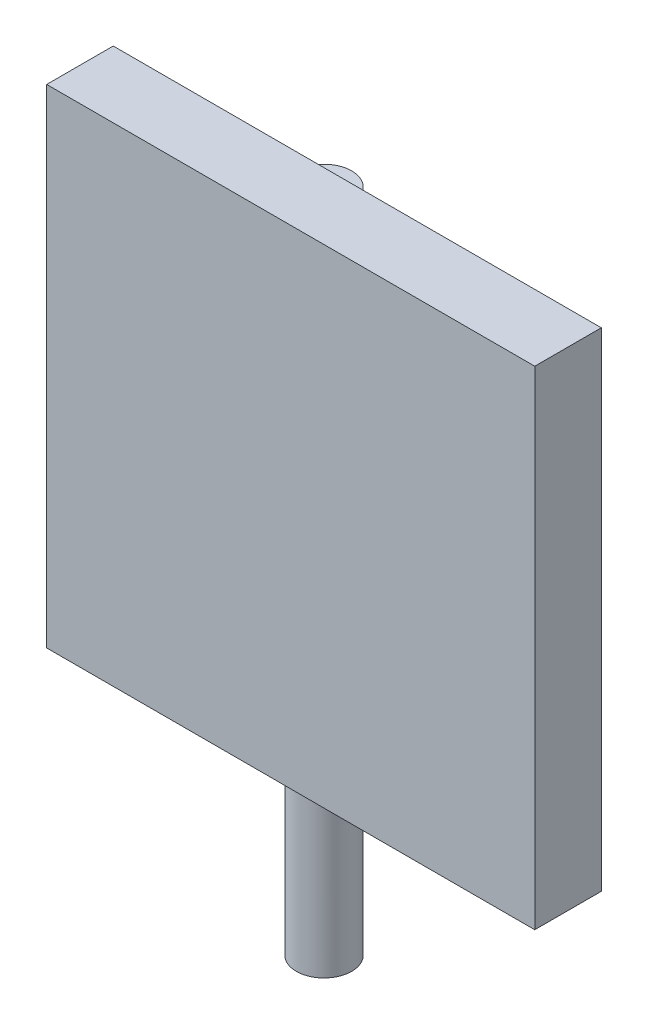
ISO-10303-21;
HEADER;
FILE_DESCRIPTION(('STEP AP214'),'2;1');
FILE_NAME('part.step','',(''),(''),'','','');
FILE_SCHEMA(('AUTOMOTIVE_DESIGN { 1 0 10303 214 1 1 1 1 }'));
ENDSEC;
DATA;
#1=APPLICATION_CONTEXT('core data for automotive mechanical design processes');
#2=APPLICATION_PROTOCOL_DEFINITION('international standard','automotive_design',2000,#1);
#3=PRODUCT_CONTEXT('',#1,'mechanical');
#4=PRODUCT('Part','Part','',(#3));
#5=PRODUCT_RELATED_PRODUCT_CATEGORY('part','',(#4));
#6=PRODUCT_DEFINITION_FORMATION('','',#4);
#7=PRODUCT_DEFINITION_CONTEXT('part definition',#1,'design');
#8=PRODUCT_DEFINITION('design','',#6,#7);
#9=PRODUCT_DEFINITION_SHAPE('','',#8);
#10=(LENGTH_UNIT() NAMED_UNIT(*) SI_UNIT(.MILLI.,.METRE.));
#11=(NAMED_UNIT(*) PLANE_ANGLE_UNIT() SI_UNIT($,.RADIAN.));
#12=(NAMED_UNIT(*) SI_UNIT($,.STERADIAN.) SOLID_ANGLE_UNIT());
#13=UNCERTAINTY_MEASURE_WITH_UNIT(LENGTH_MEASURE(1.E-05),#10,'distance_accuracy_value','');
#14=(GEOMETRIC_REPRESENTATION_CONTEXT(3) GLOBAL_UNCERTAINTY_ASSIGNED_CONTEXT((#13)) GLOBAL_UNIT_ASSIGNED_CONTEXT((#10,
#11,#12)) REPRESENTATION_CONTEXT('',''));
#15=CARTESIAN_POINT('',(0.,0.,0.));
#16=DIRECTION('',(0.,0.,1.));
#17=DIRECTION('',(1.,0.,0.));
#18=AXIS2_PLACEMENT_3D('',#15,#16,#17);
#19=CARTESIAN_POINT('',(-0.35,-2.,-0.35));
#20=DIRECTION('',(0.,1.,0.));
#21=DIRECTION('',(0.,0.,1.));
#22=AXIS2_PLACEMENT_3D('',#19,#20,#21);
#23=CYLINDRICAL_SURFACE('',#22,0.25);
#24=CARTESIAN_POINT('',(-0.35,-2.,-0.35));
#25=DIRECTION('',(0.,1.,0.));
#26=DIRECTION('',(0.,0.,1.));
#27=AXIS2_PLACEMENT_3D('',#24,#25,#26);
#28=CIRCLE('',#27,0.25);
#29=CARTESIAN_POINT('',(-0.35,-2.,-0.0999999999999999));
#30=VERTEX_POINT('',#29);
#31=EDGE_CURVE('E159',#30,#30,#28,.T.);
#32=ORIENTED_EDGE('',*,*,#31,.T.);
#33=EDGE_LOOP('',(#32));
#34=FACE_BOUND('',#33,.T.);
#35=DIRECTION('',(0.,1.,0.));
#36=VECTOR('',#35,1.);
#37=CARTESIAN_POINT('',(-0.594948974278318,-2.,-0.3));
#38=LINE('',#37,#36);
#39=CARTESIAN_POINT('',(-0.594948974278318,-0.2,-0.3));
#40=VERTEX_POINT('',#39);
#41=CARTESIAN_POINT('',(-0.594948974278318,2.7988636885254,-0.3));
#42=VERTEX_POINT('',#41);
#43=EDGE_CURVE('E96',#40,#42,#38,.T.);
#44=ORIENTED_EDGE('',*,*,#43,.T.);
#45=CARTESIAN_POINT('',(-0.548052576009361,2.85478983401999,-0.502562125978018));
#46=CARTESIAN_POINT('',(-0.543202008543193,2.8612220510604,-0.50885742511753));
#47=CARTESIAN_POINT('',(-0.538347930718746,2.86828059810136,-0.514533437571293));
#48=CARTESIAN_POINT('',(-0.529075118619217,2.88354097279515,-0.524583511362072));
#49=CARTESIAN_POINT('',(-0.524657383486016,2.89174532504693,-0.528954628962279));
#50=CARTESIAN_POINT('',(-0.516654265293776,2.90906179956785,-0.536430589960511));
#51=CARTESIAN_POINT('',(-0.513067317288927,2.91817216811837,-0.53953782261857));
#52=CARTESIAN_POINT('',(-0.506990223289609,2.9370497323301,-0.544601697251805));
#53=CARTESIAN_POINT('',(-0.504499883862837,2.94681681180254,-0.546558542165884));
#54=CARTESIAN_POINT('',(-0.500766488840566,2.96681279409123,-0.549436966167604));
#55=CARTESIAN_POINT('',(-0.499533188947957,2.97704467481745,-0.550350454401128));
#56=CARTESIAN_POINT('',(-0.498422958690316,2.99762322265023,-0.55117430708767));
#57=CARTESIAN_POINT('',(-0.4985463303092,3.00796991480084,-0.551084448203805));
#58=CARTESIAN_POINT('',(-0.500165748853604,3.02879047312154,-0.549878263131097));
#59=CARTESIAN_POINT('',(-0.501700323083507,3.0392597255361,-0.548733124867807));
#60=CARTESIAN_POINT('',(-0.5060963253598,3.05972149912948,-0.545298883032705));
#61=CARTESIAN_POINT('',(-0.50895756875432,3.06971408643934,-0.543009938657603));
#62=CARTESIAN_POINT('',(-0.515758328681564,3.08881528196592,-0.537199991584944));
#63=CARTESIAN_POINT('',(-0.519685747979267,3.0979323407376,-0.533692694895656));
#64=CARTESIAN_POINT('',(-0.528304494349502,3.11512884947606,-0.525337656720573));
#65=CARTESIAN_POINT('',(-0.532995436118317,3.12320881913967,-0.520490590478663));
#66=CARTESIAN_POINT('',(-0.542532363228607,3.137863199469,-0.50962901995439));
#67=CARTESIAN_POINT('',(-0.547366471294901,3.14448174077676,-0.503663488844636));
#68=CARTESIAN_POINT('',(-0.556918842058509,3.1565025302661,-0.490536079442963));
#69=CARTESIAN_POINT('',(-0.561637089268726,3.16190461662442,-0.483374042202022));
#70=CARTESIAN_POINT('',(-0.570602356434179,3.17156638804543,-0.467960527739688));
#71=CARTESIAN_POINT('',(-0.574845389767725,3.17581677971027,-0.459700945602831));
#72=CARTESIAN_POINT('',(-0.582508856135733,3.18323607192266,-0.442356209343175));
#73=CARTESIAN_POINT('',(-0.585928933108804,3.18640450459602,-0.433270700207614));
#74=CARTESIAN_POINT('',(-0.591972558949266,3.19201871571651,-0.413735461542384));
#75=CARTESIAN_POINT('',(-0.594507311823974,3.19438348894356,-0.403235002881581));
#76=CARTESIAN_POINT('',(-0.598204202613511,3.19814808061179,-0.381825938343379));
#77=CARTESIAN_POINT('',(-0.59936572566686,3.1995474666857,-0.370917151891363));
#78=CARTESIAN_POINT('',(-0.600271325952857,3.20152033974299,-0.348147654403344));
#79=CARTESIAN_POINT('',(-0.599903996647569,3.20202494637571,-0.3362763021986));
#80=CARTESIAN_POINT('',(-0.597486139689363,3.20196995582104,-0.312703581357384));
#81=CARTESIAN_POINT('',(-0.595435153575517,3.2014100687166,-0.301002259903734));
#82=CARTESIAN_POINT('',(-0.589732620171172,3.19907698330066,-0.278116677368247));
#83=CARTESIAN_POINT('',(-0.586081128415224,3.19730382708611,-0.266932398360888));
#84=CARTESIAN_POINT('',(-0.577389475267384,3.1923074303083,-0.245464296195152));
#85=CARTESIAN_POINT('',(-0.572350607963647,3.18908553930218,-0.235179645621969));
#86=CARTESIAN_POINT('',(-0.561728823812088,3.18127860001117,-0.216675557616232));
#87=CARTESIAN_POINT('',(-0.556223424351427,3.17682564555001,-0.20835620224082));
#88=CARTESIAN_POINT('',(-0.544830458767101,3.16638355772503,-0.193054141370618));
#89=CARTESIAN_POINT('',(-0.538943207323467,3.16039567755818,-0.186070353529365));
#90=CARTESIAN_POINT('',(-0.527888171886511,3.14758993829619,-0.174171862866939));
#91=CARTESIAN_POINT('',(-0.522705993601697,3.14090893137351,-0.169122167733849));
#92=CARTESIAN_POINT('',(-0.512841287266783,3.1264818061503,-0.160191950241107));
#93=CARTESIAN_POINT('',(-0.508158877281304,3.11873543715481,-0.156311703757402));
#94=CARTESIAN_POINT('',(-0.499565307961095,3.10233544763671,-0.149599690689523));
#95=CARTESIAN_POINT('',(-0.495659534755978,3.09367608802119,-0.146775134395681));
#96=CARTESIAN_POINT('',(-0.488864019693523,3.07572597135363,-0.142072403569958));
#97=CARTESIAN_POINT('',(-0.485974632885488,3.06643499501172,-0.140194559649458));
#98=CARTESIAN_POINT('',(-0.481124984435367,3.04657929454519,-0.137126038506292));
#99=CARTESIAN_POINT('',(-0.479273790359928,3.03597576856324,-0.13601386120064));
#100=CARTESIAN_POINT('',(-0.477009799380857,3.01455967286893,-0.134662575982725));
#101=CARTESIAN_POINT('',(-0.476597675593159,3.00374700771004,-0.134423876631693));
#102=CARTESIAN_POINT('',(-0.47725154023492,2.98142787623375,-0.134808680475068));
#103=CARTESIAN_POINT('',(-0.478421986149528,2.96992528085862,-0.135493106950714));
#104=CARTESIAN_POINT('',(-0.482376734512467,2.9473102381246,-0.137911033463218));
#105=CARTESIAN_POINT('',(-0.485161248927149,2.93619784221168,-0.139644671288297));
#106=CARTESIAN_POINT('',(-0.492170800172916,2.91479184103931,-0.144318147356757));
#107=CARTESIAN_POINT('',(-0.496385250541526,2.90449288527998,-0.147249152587677));
#108=CARTESIAN_POINT('',(-0.505975369806625,2.88499986422114,-0.154532242120367));
#109=CARTESIAN_POINT('',(-0.511349835789541,2.87580466959926,-0.158882856688924));
#110=CARTESIAN_POINT('',(-0.522317690784189,2.85957407730255,-0.168737697129028));
#111=CARTESIAN_POINT('',(-0.527853817663762,2.85242162561762,-0.174112728570448));
#112=CARTESIAN_POINT('',(-0.539057483302643,2.83950185234097,-0.186216696605798));
#113=CARTESIAN_POINT('',(-0.544724964438923,2.83373393553123,-0.192945049105961));
#114=CARTESIAN_POINT('',(-0.555306291708046,2.82399666130811,-0.207095885661372));
#115=CARTESIAN_POINT('',(-0.560244913274749,2.8199262744263,-0.214431011513146));
#116=CARTESIAN_POINT('',(-0.569497790969648,2.81293635850675,-0.229988848081779));
#117=CARTESIAN_POINT('',(-0.573811853908335,2.81001718508493,-0.238211832065089));
#118=CARTESIAN_POINT('',(-0.581730678455476,2.80510631235471,-0.255678620172302));
#119=CARTESIAN_POINT('',(-0.585299972228709,2.8031565954451,-0.264950166537947));
#120=CARTESIAN_POINT('',(-0.591334880858894,2.80020911182098,-0.283989524465572));
#121=CARTESIAN_POINT('',(-0.593800048993574,2.79921173023094,-0.293757535117365));
#122=CARTESIAN_POINT('',(-0.59772850045601,2.79798543424856,-0.314586888500821));
#123=CARTESIAN_POINT('',(-0.599062709362846,2.79784607726919,-0.325677945174561));
#124=CARTESIAN_POINT('',(-0.600239395511994,2.79848733721917,-0.347913568120346));
#125=CARTESIAN_POINT('',(-0.6000812970576,2.79926830908782,-0.359058153385222));
#126=CARTESIAN_POINT('',(-0.598241310360561,2.8018415716617,-0.381870000529955));
#127=CARTESIAN_POINT('',(-0.596457685690077,2.80369832743501,-0.393522025546678));
#128=CARTESIAN_POINT('',(-0.591347024468915,2.8085919689269,-0.416234818540963));
#129=CARTESIAN_POINT('',(-0.588019175906858,2.81162947539235,-0.427295272031092));
#130=CARTESIAN_POINT('',(-0.580108289046119,2.8190578410831,-0.448365438645491));
#131=CARTESIAN_POINT('',(-0.575535454960376,2.82343773296812,-0.458382816222206));
#132=CARTESIAN_POINT('',(-0.56555124049254,2.83375873492558,-0.477079560964037));
#133=CARTESIAN_POINT('',(-0.560142865645287,2.83969430037438,-0.485763509719781));
#134=CARTESIAN_POINT('',(-0.552440592671816,2.8490982263152,-0.496739471635907));
#135=CARTESIAN_POINT('',(-0.550246943556109,2.85187993771909,-0.499714170511948));
#136=CARTESIAN_POINT('',(-0.548052576009361,2.85478983401999,-0.502562125978018));
#137=B_SPLINE_CURVE_WITH_KNOTS('',3,(#45,#46,#47,#48,#49,#50,#51,#52,#53,#54,#55,#56,#57,#58,
#59,#60,#61,#62,#63,#64,#65,#66,#67,#68,#69,#70,#71,#72,#73,#74,#75,#76,#77,#78,#79,#80,#81,#82,
#83,#84,#85,#86,#87,#88,#89,#90,#91,#92,#93,#94,#95,#96,#97,#98,#99,#100,#101,#102,#103,#104,
#105,#106,#107,#108,#109,#110,#111,#112,#113,#114,#115,#116,#117,#118,#119,#120,#121,#122,#123,
#124,#125,#126,#127,#128,#129,#130,#131,#132,#133,#134,#135,#136),.UNSPECIFIED.,.T.,.F.,(4,2,2,
2,2,2,2,2,2,2,2,2,2,2,2,2,2,2,2,2,2,2,2,2,2,2,2,2,2,2,2,2,2,2,2,2,2,2,2,2,2,2,2,2,2,4),(0.,
0.0306583779628586,0.0613854049703101,0.0920540722939377,0.122717327759836,0.15361678486407,
0.184523120072407,0.216299112353373,0.248070683233675,0.279495829415508,0.310905166111879,
0.341170040783311,0.371438939172601,0.401945267311746,0.432464770721909,0.465497747673875,
0.498545509494274,0.534042029388316,0.569548218217053,0.605053175144985,0.640525126018629,
0.673113706636573,0.705675764439744,0.735079233119791,0.764489632734266,0.794097383762299,
0.823715467274505,0.856040800206615,0.888381251082816,0.922963845001523,0.957550981483018,
0.991887447315796,1.0261884765199,1.05757927799748,1.08895656015611,1.11802777441141,
1.14710796189736,1.17735668342611,1.20761763236587,1.24098999171661,1.27437522585631,
1.31000509649681,1.34565372394014,1.38101853258614,1.41625897112802,1.43012863691596),.UNSPECIFIED.);
#138=CARTESIAN_POINT('',(-0.594948974278318,3.20113631147461,-0.3));
#139=VERTEX_POINT('',#138);
#140=EDGE_CURVE('E100',#42,#139,#137,.T.);
#141=ORIENTED_EDGE('',*,*,#140,.T.);
#142=CARTESIAN_POINT('',(-0.594948974278318,4.,-0.3));
#143=VERTEX_POINT('',#142);
#144=EDGE_CURVE('E91',#139,#143,#38,.T.);
#145=ORIENTED_EDGE('',*,*,#144,.T.);
#146=CARTESIAN_POINT('',(-0.35,4.,-0.35));
#147=DIRECTION('',(0.,-1.,0.));
#148=DIRECTION('',(1.,0.,0.));
#149=AXIS2_PLACEMENT_3D('',#146,#147,#148);
#150=CIRCLE('',#149,0.25);
#151=CARTESIAN_POINT('',(-0.105051025721682,4.,-0.3));
#152=VERTEX_POINT('',#151);
#153=EDGE_CURVE('E160',#143,#152,#150,.T.);
#154=ORIENTED_EDGE('',*,*,#153,.T.);
#155=DIRECTION('',(0.,1.,0.));
#156=VECTOR('',#155,1.);
#157=CARTESIAN_POINT('',(-0.105051025721682,-2.,-0.3));
#158=LINE('',#157,#156);
#159=CARTESIAN_POINT('',(-0.105051025721682,-0.2,-0.3));
#160=VERTEX_POINT('',#159);
#161=EDGE_CURVE('E55',#152,#160,#158,.F.);
#162=ORIENTED_EDGE('',*,*,#161,.T.);
#163=CARTESIAN_POINT('',(-0.35,-0.2,-0.35));
#164=DIRECTION('',(0.,1.,0.));
#165=DIRECTION('',(0.,0.,1.));
#166=AXIS2_PLACEMENT_3D('',#163,#164,#165);
#167=CIRCLE('',#166,0.25);
#168=EDGE_CURVE('E42',#160,#40,#167,.F.);
#169=ORIENTED_EDGE('',*,*,#168,.T.);
#170=EDGE_LOOP('',(#44,#141,#145,#154,#162,#169));
#171=FACE_BOUND('',#170,.T.);
#172=ADVANCED_FACE('F34',(#34,#171),#23,.T.);
#173=CARTESIAN_POINT('',(-2.,4.,0.1));
#174=DIRECTION('',(0.,-1.,0.));
#175=DIRECTION('',(1.,0.,0.));
#176=AXIS2_PLACEMENT_3D('',#173,#174,#175);
#177=PLANE('',#176);
#178=DIRECTION('',(-1.,0.,0.));
#179=VECTOR('',#178,1.);
#180=CARTESIAN_POINT('',(-2.,4.,-0.3));
#181=LINE('',#180,#179);
#182=EDGE_CURVE('E94',#152,#143,#181,.T.);
#183=ORIENTED_EDGE('',*,*,#182,.F.);
#184=ORIENTED_EDGE('',*,*,#153,.F.);
#185=EDGE_LOOP('',(#183,#184));
#186=FACE_BOUND('',#185,.T.);
#187=ADVANCED_FACE('F146',(#186),#177,.F.);
#188=CARTESIAN_POINT('',(-0.35,-2.,-0.35));
#189=DIRECTION('',(0.,1.,0.));
#190=DIRECTION('',(0.,0.,1.));
#191=AXIS2_PLACEMENT_3D('',#188,#189,#190);
#192=PLANE('',#191);
#193=ORIENTED_EDGE('',*,*,#31,.F.);
#194=EDGE_LOOP('',(#193));
#195=FACE_BOUND('',#194,.T.);
#196=ADVANCED_FACE('F144',(#195),#192,.F.);
#197=CARTESIAN_POINT('',(2.2,4.2,0.3));
#198=DIRECTION('',(0.,-1.,0.));
#199=DIRECTION('',(1.,0.,0.));
#200=AXIS2_PLACEMENT_3D('',#197,#198,#199);
#201=PLANE('',#200);
#202=DIRECTION('',(-1.,0.,0.));
#203=VECTOR('',#202,1.);
#204=CARTESIAN_POINT('',(2.2,4.2,-0.3));
#205=LINE('',#204,#203);
#206=CARTESIAN_POINT('',(2.2,4.2,-0.3));
#207=VERTEX_POINT('',#206);
#208=CARTESIAN_POINT('',(-2.2,4.2,-0.3));
#209=VERTEX_POINT('',#208);
#210=EDGE_CURVE('E102',#207,#209,#205,.T.);
#211=ORIENTED_EDGE('',*,*,#210,.T.);
#212=DIRECTION('',(0.,0.,-1.));
#213=VECTOR('',#212,1.);
#214=CARTESIAN_POINT('',(-2.2,4.2,0.3));
#215=LINE('',#214,#213);
#216=CARTESIAN_POINT('',(-2.2,4.2,0.3));
#217=VERTEX_POINT('',#216);
#218=EDGE_CURVE('E97',#217,#209,#215,.T.);
#219=ORIENTED_EDGE('',*,*,#218,.F.);
#220=DIRECTION('',(-1.,0.,0.));
#221=VECTOR('',#220,1.);
#222=CARTESIAN_POINT('',(2.2,4.2,0.3));
#223=LINE('',#222,#221);
#224=CARTESIAN_POINT('',(2.2,4.2,0.3));
#225=VERTEX_POINT('',#224);
#226=EDGE_CURVE('E118',#225,#217,#223,.T.);
#227=ORIENTED_EDGE('',*,*,#226,.F.);
#228=DIRECTION('',(0.,0.,-1.));
#229=VECTOR('',#228,1.);
#230=CARTESIAN_POINT('',(2.2,4.2,0.3));
#231=LINE('',#230,#229);
#232=EDGE_CURVE('E181',#225,#207,#231,.T.);
#233=ORIENTED_EDGE('',*,*,#232,.T.);
#234=EDGE_LOOP('',(#211,#219,#227,#233));
#235=FACE_BOUND('',#234,.T.);
#236=ADVANCED_FACE('F140',(#235),#201,.F.);
#237=CARTESIAN_POINT('',(-2.2,4.2,0.3));
#238=DIRECTION('',(1.,0.,0.));
#239=DIRECTION('',(0.,1.,0.));
#240=AXIS2_PLACEMENT_3D('',#237,#238,#239);
#241=PLANE('',#240);
#242=DIRECTION('',(0.,-1.,0.));
#243=VECTOR('',#242,1.);
#244=CARTESIAN_POINT('',(-2.2,4.2,-0.3));
#245=LINE('',#244,#243);
#246=CARTESIAN_POINT('',(-2.2,-0.2,-0.3));
#247=VERTEX_POINT('',#246);
#248=EDGE_CURVE('E177',#209,#247,#245,.T.);
#249=ORIENTED_EDGE('',*,*,#248,.T.);
#250=DIRECTION('',(0.,0.,-1.));
#251=VECTOR('',#250,1.);
#252=CARTESIAN_POINT('',(-2.2,-0.2,0.3));
#253=LINE('',#252,#251);
#254=CARTESIAN_POINT('',(-2.2,-0.2,0.3));
#255=VERTEX_POINT('',#254);
#256=EDGE_CURVE('E172',#255,#247,#253,.T.);
#257=ORIENTED_EDGE('',*,*,#256,.F.);
#258=DIRECTION('',(0.,-1.,0.));
#259=VECTOR('',#258,1.);
#260=CARTESIAN_POINT('',(-2.2,4.2,0.3));
#261=LINE('',#260,#259);
#262=EDGE_CURVE('E192',#217,#255,#261,.T.);
#263=ORIENTED_EDGE('',*,*,#262,.F.);
#264=ORIENTED_EDGE('',*,*,#218,.T.);
#265=EDGE_LOOP('',(#249,#257,#263,#264));
#266=FACE_BOUND('',#265,.T.);
#267=ADVANCED_FACE('F136',(#266),#241,.F.);
#268=CARTESIAN_POINT('',(-2.2,-0.2,0.3));
#269=DIRECTION('',(0.,1.,0.));
#270=DIRECTION('',(0.,0.,1.));
#271=AXIS2_PLACEMENT_3D('',#268,#269,#270);
#272=PLANE('',#271);
#273=ORIENTED_EDGE('',*,*,#168,.F.);
#274=DIRECTION('',(1.,0.,0.));
#275=VECTOR('',#274,1.);
#276=CARTESIAN_POINT('',(-2.2,-0.2,-0.3));
#277=LINE('',#276,#275);
#278=CARTESIAN_POINT('',(2.2,-0.2,-0.3));
#279=VERTEX_POINT('',#278);
#280=EDGE_CURVE('E174',#160,#279,#277,.T.);
#281=ORIENTED_EDGE('',*,*,#280,.T.);
#282=DIRECTION('',(0.,0.,-1.));
#283=VECTOR('',#282,1.);
#284=CARTESIAN_POINT('',(2.2,-0.2,0.3));
#285=LINE('',#284,#283);
#286=CARTESIAN_POINT('',(2.2,-0.2,0.3));
#287=VERTEX_POINT('',#286);
#288=EDGE_CURVE('E184',#287,#279,#285,.T.);
#289=ORIENTED_EDGE('',*,*,#288,.F.);
#290=DIRECTION('',(1.,0.,0.));
#291=VECTOR('',#290,1.);
#292=CARTESIAN_POINT('',(-2.2,-0.2,0.3));
#293=LINE('',#292,#291);
#294=EDGE_CURVE('E200',#255,#287,#293,.T.);
#295=ORIENTED_EDGE('',*,*,#294,.F.);
#296=ORIENTED_EDGE('',*,*,#256,.T.);
#297=EDGE_CURVE('E168',#247,#40,#277,.T.);
#298=ORIENTED_EDGE('',*,*,#297,.T.);
#299=EDGE_LOOP('',(#273,#281,#289,#295,#296,#298));
#300=FACE_BOUND('',#299,.T.);
#301=ADVANCED_FACE('F132',(#300),#272,.F.);
#302=CARTESIAN_POINT('',(2.2,-0.2,0.3));
#303=DIRECTION('',(-1.,0.,0.));
#304=DIRECTION('',(0.,-1.,0.));
#305=AXIS2_PLACEMENT_3D('',#302,#303,#304);
#306=PLANE('',#305);
#307=DIRECTION('',(0.,1.,0.));
#308=VECTOR('',#307,1.);
#309=CARTESIAN_POINT('',(2.2,-0.2,-0.3));
#310=LINE('',#309,#308);
#311=EDGE_CURVE('E173',#279,#207,#310,.T.);
#312=ORIENTED_EDGE('',*,*,#311,.T.);
#313=ORIENTED_EDGE('',*,*,#232,.F.);
#314=DIRECTION('',(0.,1.,0.));
#315=VECTOR('',#314,1.);
#316=CARTESIAN_POINT('',(2.2,-0.2,0.3));
#317=LINE('',#316,#315);
#318=EDGE_CURVE('E185',#287,#225,#317,.T.);
#319=ORIENTED_EDGE('',*,*,#318,.F.);
#320=ORIENTED_EDGE('',*,*,#288,.T.);
#321=EDGE_LOOP('',(#312,#313,#319,#320));
#322=FACE_BOUND('',#321,.T.);
#323=ADVANCED_FACE('F126',(#322),#306,.F.);
#324=CARTESIAN_POINT('',(0.,0.,0.3));
#325=DIRECTION('',(0.,0.,1.));
#326=DIRECTION('',(1.,0.,0.));
#327=AXIS2_PLACEMENT_3D('',#324,#325,#326);
#328=PLANE('',#327);
#329=ORIENTED_EDGE('',*,*,#226,.T.);
#330=ORIENTED_EDGE('',*,*,#262,.T.);
#331=ORIENTED_EDGE('',*,*,#294,.T.);
#332=ORIENTED_EDGE('',*,*,#318,.T.);
#333=EDGE_LOOP('',(#329,#330,#331,#332));
#334=FACE_BOUND('',#333,.T.);
#335=ADVANCED_FACE('F123',(#334),#328,.T.);
#336=CARTESIAN_POINT('',(0.,0.,-0.3));
#337=DIRECTION('',(0.,0.,1.));
#338=DIRECTION('',(1.,0.,0.));
#339=AXIS2_PLACEMENT_3D('',#336,#337,#338);
#340=PLANE('',#339);
#341=CARTESIAN_POINT('',(-0.725,3.,-0.3));
#342=DIRECTION('',(0.,0.,1.));
#343=DIRECTION('',(1.,0.,0.));
#344=AXIS2_PLACEMENT_3D('',#341,#342,#343);
#345=CIRCLE('',#344,0.239518444143392);
#346=EDGE_CURVE('E11',#42,#139,#345,.F.);
#347=ORIENTED_EDGE('',*,*,#346,.F.);
#348=ORIENTED_EDGE('',*,*,#43,.F.);
#349=ORIENTED_EDGE('',*,*,#297,.F.);
#350=ORIENTED_EDGE('',*,*,#248,.F.);
#351=ORIENTED_EDGE('',*,*,#210,.F.);
#352=ORIENTED_EDGE('',*,*,#311,.F.);
#353=ORIENTED_EDGE('',*,*,#280,.F.);
#354=ORIENTED_EDGE('',*,*,#161,.F.);
#355=ORIENTED_EDGE('',*,*,#182,.T.);
#356=ORIENTED_EDGE('',*,*,#144,.F.);
#357=EDGE_LOOP('',(#347,#348,#349,#350,#351,#352,#353,#354,#355,#356));
#358=FACE_BOUND('',#357,.T.);
#359=ADVANCED_FACE('F93',(#358),#340,.F.);
#360=CARTESIAN_POINT('',(-0.725,3.,-0.1));
#361=DIRECTION('',(0.,0.,1.));
#362=DIRECTION('',(-1.,0.,0.));
#363=AXIS2_PLACEMENT_3D('',#360,#361,#362);
#364=CONICAL_SURFACE('',#363,0.25,0.05235987755983);
#365=ORIENTED_EDGE('',*,*,#140,.F.);
#366=ORIENTED_EDGE('',*,*,#346,.T.);
#367=EDGE_LOOP('',(#365,#366));
#368=FACE_BOUND('',#367,.T.);
#369=CARTESIAN_POINT('',(-0.725,3.,-0.6));
#370=DIRECTION('',(0.,0.,-1.));
#371=DIRECTION('',(-1.,0.,0.));
#372=AXIS2_PLACEMENT_3D('',#369,#370,#371);
#373=CIRCLE('',#372,0.22379611035848);
#374=CARTESIAN_POINT('',(-0.94879611035848,3.,-0.6));
#375=VERTEX_POINT('',#374);
#376=EDGE_CURVE('E103',#375,#375,#373,.T.);
#377=ORIENTED_EDGE('',*,*,#376,.F.);
#378=EDGE_LOOP('',(#377));
#379=FACE_BOUND('',#378,.T.);
#380=ADVANCED_FACE('F105',(#368,#379),#364,.T.);
#381=CARTESIAN_POINT('',(-0.725,3.,-0.6));
#382=DIRECTION('',(0.,0.,-1.));
#383=DIRECTION('',(-1.,0.,0.));
#384=AXIS2_PLACEMENT_3D('',#381,#382,#383);
#385=PLANE('',#384);
#386=ORIENTED_EDGE('',*,*,#376,.T.);
#387=EDGE_LOOP('',(#386));
#388=FACE_BOUND('',#387,.T.);
#389=ADVANCED_FACE('F108',(#388),#385,.T.);
#390=CLOSED_SHELL('',(#172,#187,#196,#236,#267,#301,#323,#335,#359,#380,#389));
#391=MANIFOLD_SOLID_BREP('B2',#390);
#392=ADVANCED_BREP_SHAPE_REPRESENTATION('',(#18,#391),#14);
#393=SHAPE_DEFINITION_REPRESENTATION(#9,#392);
ENDSEC;
END-ISO-10303-21;
